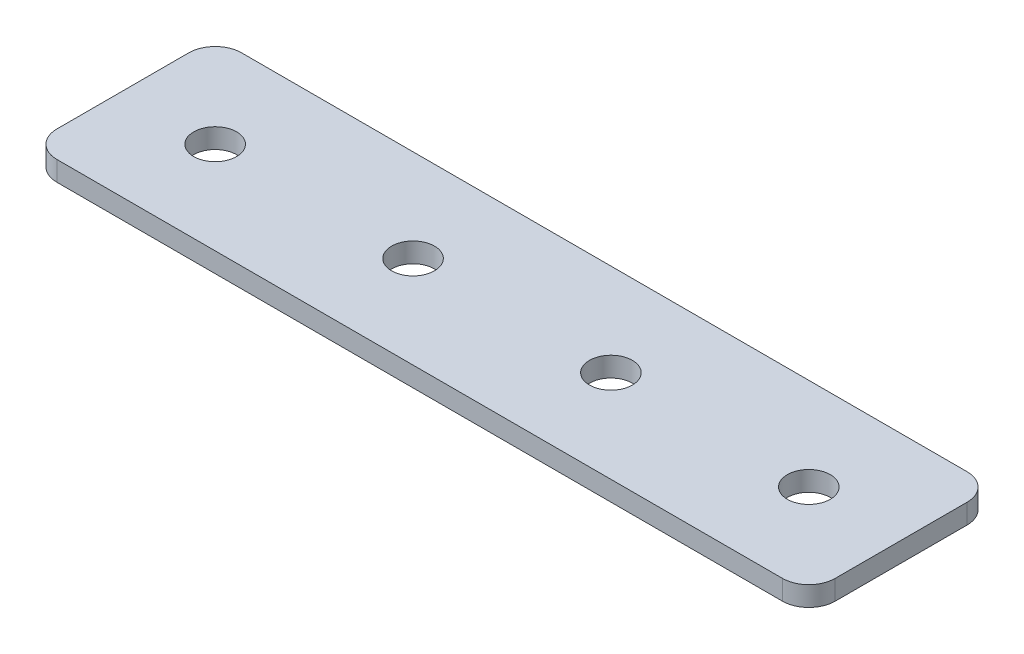
ISO-10303-21;
HEADER;
FILE_DESCRIPTION(('STEP AP214'),'2;1');
FILE_NAME('part.step','',(''),(''),'','','');
FILE_SCHEMA(('AUTOMOTIVE_DESIGN { 1 0 10303 214 1 1 1 1 }'));
ENDSEC;
DATA;
#1=APPLICATION_CONTEXT('core data for automotive mechanical design processes');
#2=APPLICATION_PROTOCOL_DEFINITION('international standard','automotive_design',2000,#1);
#3=PRODUCT_CONTEXT('',#1,'mechanical');
#4=PRODUCT('Part','Part','',(#3));
#5=PRODUCT_RELATED_PRODUCT_CATEGORY('part','',(#4));
#6=PRODUCT_DEFINITION_FORMATION('','',#4);
#7=PRODUCT_DEFINITION_CONTEXT('part definition',#1,'design');
#8=PRODUCT_DEFINITION('design','',#6,#7);
#9=PRODUCT_DEFINITION_SHAPE('','',#8);
#10=(LENGTH_UNIT() NAMED_UNIT(*) SI_UNIT(.MILLI.,.METRE.));
#11=(NAMED_UNIT(*) PLANE_ANGLE_UNIT() SI_UNIT($,.RADIAN.));
#12=(NAMED_UNIT(*) SI_UNIT($,.STERADIAN.) SOLID_ANGLE_UNIT());
#13=UNCERTAINTY_MEASURE_WITH_UNIT(LENGTH_MEASURE(1.E-05),#10,'distance_accuracy_value','');
#14=(GEOMETRIC_REPRESENTATION_CONTEXT(3) GLOBAL_UNCERTAINTY_ASSIGNED_CONTEXT((#13)) GLOBAL_UNIT_ASSIGNED_CONTEXT((#10,
#11,#12)) REPRESENTATION_CONTEXT('',''));
#15=CARTESIAN_POINT('',(0.,0.,0.));
#16=DIRECTION('',(0.,0.,1.));
#17=DIRECTION('',(1.,0.,0.));
#18=AXIS2_PLACEMENT_3D('',#15,#16,#17);
#19=CARTESIAN_POINT('',(-23.4700014306303,1.74134831022957,-1.52094199864905));
#20=DIRECTION('',(0.,-1.,0.));
#21=DIRECTION('',(0.,0.,-1.));
#22=AXIS2_PLACEMENT_3D('',#19,#20,#21);
#23=PLANE('',#22);
#24=CARTESIAN_POINT('',(21.5299985693697,1.74134831022957,-1.52094199864905));
#25=DIRECTION('',(0.,1.,0.));
#26=DIRECTION('',(0.,0.,1.));
#27=AXIS2_PLACEMENT_3D('',#24,#25,#26);
#28=CIRCLE('',#27,1.625);
#29=CARTESIAN_POINT('',(21.5299985693697,1.74134831022957,0.104058001350958));
#30=VERTEX_POINT('',#29);
#31=EDGE_CURVE('E169',#30,#30,#28,.T.);
#32=ORIENTED_EDGE('',*,*,#31,.T.);
#33=EDGE_LOOP('',(#32));
#34=FACE_BOUND('',#33,.T.);
#35=CARTESIAN_POINT('',(6.5299985693697,1.74134831022957,-1.52094199864905));
#36=DIRECTION('',(0.,1.,0.));
#37=DIRECTION('',(0.,0.,1.));
#38=AXIS2_PLACEMENT_3D('',#35,#36,#37);
#39=CIRCLE('',#38,1.625);
#40=CARTESIAN_POINT('',(6.5299985693697,1.74134831022957,0.104058001350958));
#41=VERTEX_POINT('',#40);
#42=EDGE_CURVE('E163',#41,#41,#39,.T.);
#43=ORIENTED_EDGE('',*,*,#42,.T.);
#44=EDGE_LOOP('',(#43));
#45=FACE_BOUND('',#44,.T.);
#46=CARTESIAN_POINT('',(-8.47000143063031,1.74134831022957,-1.52094199864904));
#47=DIRECTION('',(0.,1.,0.));
#48=DIRECTION('',(0.,0.,1.));
#49=AXIS2_PLACEMENT_3D('',#46,#47,#48);
#50=CIRCLE('',#49,1.625);
#51=CARTESIAN_POINT('',(-8.47000143063031,1.74134831022957,0.104058001350964));
#52=VERTEX_POINT('',#51);
#53=EDGE_CURVE('E157',#52,#52,#50,.T.);
#54=ORIENTED_EDGE('',*,*,#53,.T.);
#55=EDGE_LOOP('',(#54));
#56=FACE_BOUND('',#55,.T.);
#57=CARTESIAN_POINT('',(-23.4700014306303,1.74134831022957,-1.52094199864905));
#58=DIRECTION('',(0.,1.,0.));
#59=DIRECTION('',(0.,0.,1.));
#60=AXIS2_PLACEMENT_3D('',#57,#58,#59);
#61=CIRCLE('',#60,1.625);
#62=CARTESIAN_POINT('',(-23.4700014306303,1.74134831022957,0.104058001350954));
#63=VERTEX_POINT('',#62);
#64=EDGE_CURVE('E103',#63,#63,#61,.T.);
#65=ORIENTED_EDGE('',*,*,#64,.T.);
#66=EDGE_LOOP('',(#65));
#67=FACE_BOUND('',#66,.T.);
#68=DIRECTION('',(0.,0.,-1.));
#69=VECTOR('',#68,1.);
#70=CARTESIAN_POINT('',(28.5299985693696,1.74134831022957,5.47905800135099));
#71=LINE('',#70,#69);
#72=CARTESIAN_POINT('',(28.5299985693696,1.74134831022957,3.47905800135099));
#73=VERTEX_POINT('',#72);
#74=CARTESIAN_POINT('',(28.5299985693696,1.74134831022957,-6.52094199864909));
#75=VERTEX_POINT('',#74);
#76=EDGE_CURVE('E150',#73,#75,#71,.T.);
#77=ORIENTED_EDGE('',*,*,#76,.F.);
#78=CARTESIAN_POINT('',(26.5299985693696,1.74134831022957,3.47905800135099));
#79=DIRECTION('',(0.,-1.,0.));
#80=DIRECTION('',(0.,0.,-1.));
#81=AXIS2_PLACEMENT_3D('',#78,#79,#80);
#82=CIRCLE('',#81,2.);
#83=CARTESIAN_POINT('',(26.5299985693696,1.74134831022957,5.47905800135099));
#84=VERTEX_POINT('',#83);
#85=EDGE_CURVE('E130',#73,#84,#82,.T.);
#86=ORIENTED_EDGE('',*,*,#85,.T.);
#87=DIRECTION('',(1.,0.,0.));
#88=VECTOR('',#87,1.);
#89=CARTESIAN_POINT('',(-16.4700014306302,1.74134831022957,5.47905800135099));
#90=LINE('',#89,#88);
#91=CARTESIAN_POINT('',(-28.4700014306304,1.74134831022957,5.47905800135099));
#92=VERTEX_POINT('',#91);
#93=EDGE_CURVE('E146',#92,#84,#90,.T.);
#94=ORIENTED_EDGE('',*,*,#93,.F.);
#95=CARTESIAN_POINT('',(-28.4700014306304,1.74134831022957,3.47905800135099));
#96=DIRECTION('',(0.,-1.,0.));
#97=DIRECTION('',(0.,0.,-1.));
#98=AXIS2_PLACEMENT_3D('',#95,#96,#97);
#99=CIRCLE('',#98,2.);
#100=CARTESIAN_POINT('',(-30.4700014306304,1.74134831022957,3.47905800135099));
#101=VERTEX_POINT('',#100);
#102=EDGE_CURVE('E106',#92,#101,#99,.T.);
#103=ORIENTED_EDGE('',*,*,#102,.T.);
#104=DIRECTION('',(0.,0.,1.));
#105=VECTOR('',#104,1.);
#106=CARTESIAN_POINT('',(-30.4700014306304,1.74134831022957,-8.52094199864908));
#107=LINE('',#106,#105);
#108=CARTESIAN_POINT('',(-30.4700014306304,1.74134831022957,-6.52094199864908));
#109=VERTEX_POINT('',#108);
#110=EDGE_CURVE('E107',#109,#101,#107,.T.);
#111=ORIENTED_EDGE('',*,*,#110,.F.);
#112=CARTESIAN_POINT('',(-28.4700014306304,1.74134831022957,-6.52094199864908));
#113=DIRECTION('',(0.,-1.,0.));
#114=DIRECTION('',(0.,0.,-1.));
#115=AXIS2_PLACEMENT_3D('',#112,#113,#114);
#116=CIRCLE('',#115,2.);
#117=CARTESIAN_POINT('',(-28.4700014306304,1.74134831022957,-8.52094199864908));
#118=VERTEX_POINT('',#117);
#119=EDGE_CURVE('E31',#109,#118,#116,.T.);
#120=ORIENTED_EDGE('',*,*,#119,.T.);
#121=DIRECTION('',(-1.,0.,0.));
#122=VECTOR('',#121,1.);
#123=CARTESIAN_POINT('',(28.5299985693696,1.74134831022957,-8.52094199864909));
#124=LINE('',#123,#122);
#125=CARTESIAN_POINT('',(26.5299985693696,1.74134831022957,-8.52094199864909));
#126=VERTEX_POINT('',#125);
#127=EDGE_CURVE('E111',#126,#118,#124,.T.);
#128=ORIENTED_EDGE('',*,*,#127,.F.);
#129=CARTESIAN_POINT('',(26.5299985693696,1.74134831022957,-6.52094199864909));
#130=DIRECTION('',(0.,-1.,0.));
#131=DIRECTION('',(0.,0.,-1.));
#132=AXIS2_PLACEMENT_3D('',#129,#130,#131);
#133=CIRCLE('',#132,2.);
#134=EDGE_CURVE('E128',#126,#75,#133,.T.);
#135=ORIENTED_EDGE('',*,*,#134,.T.);
#136=EDGE_LOOP('',(#77,#86,#94,#103,#111,#120,#128,#135));
#137=FACE_BOUND('',#136,.T.);
#138=ADVANCED_FACE('F16',(#34,#45,#56,#67,#137),#23,.T.);
#139=CARTESIAN_POINT('',(-16.4700014306302,1.74134831022957,5.47905800135099));
#140=DIRECTION('',(0.,0.,1.));
#141=DIRECTION('',(1.,0.,0.));
#142=AXIS2_PLACEMENT_3D('',#139,#140,#141);
#143=PLANE('',#142);
#144=ORIENTED_EDGE('',*,*,#93,.T.);
#145=DIRECTION('',(0.,1.,0.));
#146=VECTOR('',#145,1.);
#147=CARTESIAN_POINT('',(26.5299985693696,1.74134831022957,5.47905800135099));
#148=LINE('',#147,#146);
#149=CARTESIAN_POINT('',(26.5299985693696,3.24134831022957,5.47905800135099));
#150=VERTEX_POINT('',#149);
#151=EDGE_CURVE('E93',#84,#150,#148,.T.);
#152=ORIENTED_EDGE('',*,*,#151,.T.);
#153=DIRECTION('',(1.,0.,0.));
#154=VECTOR('',#153,1.);
#155=CARTESIAN_POINT('',(-16.4700014306302,3.24134831022957,5.47905800135099));
#156=LINE('',#155,#154);
#157=CARTESIAN_POINT('',(-28.4700014306304,3.24134831022957,5.47905800135099));
#158=VERTEX_POINT('',#157);
#159=EDGE_CURVE('E85',#158,#150,#156,.T.);
#160=ORIENTED_EDGE('',*,*,#159,.F.);
#161=DIRECTION('',(0.,1.,0.));
#162=VECTOR('',#161,1.);
#163=CARTESIAN_POINT('',(-28.4700014306304,1.74134831022957,5.47905800135099));
#164=LINE('',#163,#162);
#165=EDGE_CURVE('E99',#158,#92,#164,.F.);
#166=ORIENTED_EDGE('',*,*,#165,.T.);
#167=EDGE_LOOP('',(#144,#152,#160,#166));
#168=FACE_BOUND('',#167,.T.);
#169=ADVANCED_FACE('F98',(#168),#143,.T.);
#170=CARTESIAN_POINT('',(-30.4700014306304,1.74134831022957,-8.52094199864908));
#171=DIRECTION('',(-1.,0.,0.));
#172=DIRECTION('',(0.,0.,1.));
#173=AXIS2_PLACEMENT_3D('',#170,#171,#172);
#174=PLANE('',#173);
#175=DIRECTION('',(0.,0.,1.));
#176=VECTOR('',#175,1.);
#177=CARTESIAN_POINT('',(-30.4700014306304,3.24134831022957,-8.52094199864908));
#178=LINE('',#177,#176);
#179=CARTESIAN_POINT('',(-30.4700014306304,3.24134831022957,-6.52094199864908));
#180=VERTEX_POINT('',#179);
#181=CARTESIAN_POINT('',(-30.4700014306304,3.24134831022957,3.47905800135099));
#182=VERTEX_POINT('',#181);
#183=EDGE_CURVE('E87',#180,#182,#178,.T.);
#184=ORIENTED_EDGE('',*,*,#183,.F.);
#185=DIRECTION('',(0.,1.,0.));
#186=VECTOR('',#185,1.);
#187=CARTESIAN_POINT('',(-30.4700014306304,1.74134831022957,-6.52094199864908));
#188=LINE('',#187,#186);
#189=EDGE_CURVE('E10',#180,#109,#188,.F.);
#190=ORIENTED_EDGE('',*,*,#189,.T.);
#191=ORIENTED_EDGE('',*,*,#110,.T.);
#192=DIRECTION('',(0.,1.,0.));
#193=VECTOR('',#192,1.);
#194=CARTESIAN_POINT('',(-30.4700014306304,1.74134831022957,3.47905800135099));
#195=LINE('',#194,#193);
#196=EDGE_CURVE('E24',#101,#182,#195,.T.);
#197=ORIENTED_EDGE('',*,*,#196,.T.);
#198=EDGE_LOOP('',(#184,#190,#191,#197));
#199=FACE_BOUND('',#198,.T.);
#200=ADVANCED_FACE('F136',(#199),#174,.T.);
#201=CARTESIAN_POINT('',(28.5299985693696,1.74134831022957,-8.52094199864909));
#202=DIRECTION('',(0.,0.,-1.));
#203=DIRECTION('',(-1.,0.,0.));
#204=AXIS2_PLACEMENT_3D('',#201,#202,#203);
#205=PLANE('',#204);
#206=DIRECTION('',(-1.,0.,0.));
#207=VECTOR('',#206,1.);
#208=CARTESIAN_POINT('',(28.5299985693696,3.24134831022957,-8.52094199864909));
#209=LINE('',#208,#207);
#210=CARTESIAN_POINT('',(26.5299985693696,3.24134831022957,-8.52094199864909));
#211=VERTEX_POINT('',#210);
#212=CARTESIAN_POINT('',(-28.4700014306304,3.24134831022957,-8.52094199864908));
#213=VERTEX_POINT('',#212);
#214=EDGE_CURVE('E144',#211,#213,#209,.T.);
#215=ORIENTED_EDGE('',*,*,#214,.F.);
#216=DIRECTION('',(0.,1.,0.));
#217=VECTOR('',#216,1.);
#218=CARTESIAN_POINT('',(26.5299985693696,1.74134831022957,-8.52094199864909));
#219=LINE('',#218,#217);
#220=EDGE_CURVE('E38',#211,#126,#219,.F.);
#221=ORIENTED_EDGE('',*,*,#220,.T.);
#222=ORIENTED_EDGE('',*,*,#127,.T.);
#223=DIRECTION('',(0.,1.,0.));
#224=VECTOR('',#223,1.);
#225=CARTESIAN_POINT('',(-28.4700014306304,1.74134831022957,-8.52094199864908));
#226=LINE('',#225,#224);
#227=EDGE_CURVE('E132',#118,#213,#226,.T.);
#228=ORIENTED_EDGE('',*,*,#227,.T.);
#229=EDGE_LOOP('',(#215,#221,#222,#228));
#230=FACE_BOUND('',#229,.T.);
#231=ADVANCED_FACE('F143',(#230),#205,.T.);
#232=CARTESIAN_POINT('',(28.5299985693696,1.74134831022957,5.47905800135099));
#233=DIRECTION('',(1.,0.,0.));
#234=DIRECTION('',(0.,0.,-1.));
#235=AXIS2_PLACEMENT_3D('',#232,#233,#234);
#236=PLANE('',#235);
#237=DIRECTION('',(0.,0.,-1.));
#238=VECTOR('',#237,1.);
#239=CARTESIAN_POINT('',(28.5299985693696,3.24134831022957,5.47905800135099));
#240=LINE('',#239,#238);
#241=CARTESIAN_POINT('',(28.5299985693696,3.24134831022957,3.47905800135099));
#242=VERTEX_POINT('',#241);
#243=CARTESIAN_POINT('',(28.5299985693696,3.24134831022957,-6.52094199864909));
#244=VERTEX_POINT('',#243);
#245=EDGE_CURVE('E102',#242,#244,#240,.T.);
#246=ORIENTED_EDGE('',*,*,#245,.F.);
#247=DIRECTION('',(0.,1.,0.));
#248=VECTOR('',#247,1.);
#249=CARTESIAN_POINT('',(28.5299985693696,1.74134831022957,3.47905800135099));
#250=LINE('',#249,#248);
#251=EDGE_CURVE('E124',#242,#73,#250,.F.);
#252=ORIENTED_EDGE('',*,*,#251,.T.);
#253=ORIENTED_EDGE('',*,*,#76,.T.);
#254=DIRECTION('',(0.,1.,0.));
#255=VECTOR('',#254,1.);
#256=CARTESIAN_POINT('',(28.5299985693696,1.74134831022957,-6.52094199864909));
#257=LINE('',#256,#255);
#258=EDGE_CURVE('E121',#75,#244,#257,.T.);
#259=ORIENTED_EDGE('',*,*,#258,.T.);
#260=EDGE_LOOP('',(#246,#252,#253,#259));
#261=FACE_BOUND('',#260,.T.);
#262=ADVANCED_FACE('F191',(#261),#236,.T.);
#263=CARTESIAN_POINT('',(-23.4700014306303,3.24134831022957,-1.52094199864905));
#264=DIRECTION('',(0.,-1.,0.));
#265=DIRECTION('',(0.,0.,-1.));
#266=AXIS2_PLACEMENT_3D('',#263,#264,#265);
#267=PLANE('',#266);
#268=CARTESIAN_POINT('',(21.5299985693697,3.24134831022957,-1.52094199864905));
#269=DIRECTION('',(0.,1.,0.));
#270=DIRECTION('',(0.,0.,1.));
#271=AXIS2_PLACEMENT_3D('',#268,#269,#270);
#272=CIRCLE('',#271,1.625);
#273=CARTESIAN_POINT('',(21.5299985693697,3.24134831022957,0.104058001350958));
#274=VERTEX_POINT('',#273);
#275=EDGE_CURVE('E172',#274,#274,#272,.T.);
#276=ORIENTED_EDGE('',*,*,#275,.F.);
#277=EDGE_LOOP('',(#276));
#278=FACE_BOUND('',#277,.T.);
#279=CARTESIAN_POINT('',(6.5299985693697,3.24134831022957,-1.52094199864905));
#280=DIRECTION('',(0.,1.,0.));
#281=DIRECTION('',(0.,0.,1.));
#282=AXIS2_PLACEMENT_3D('',#279,#280,#281);
#283=CIRCLE('',#282,1.625);
#284=CARTESIAN_POINT('',(6.5299985693697,3.24134831022957,0.104058001350958));
#285=VERTEX_POINT('',#284);
#286=EDGE_CURVE('E166',#285,#285,#283,.T.);
#287=ORIENTED_EDGE('',*,*,#286,.F.);
#288=EDGE_LOOP('',(#287));
#289=FACE_BOUND('',#288,.T.);
#290=CARTESIAN_POINT('',(-8.47000143063031,3.24134831022957,-1.52094199864904));
#291=DIRECTION('',(0.,1.,0.));
#292=DIRECTION('',(0.,0.,1.));
#293=AXIS2_PLACEMENT_3D('',#290,#291,#292);
#294=CIRCLE('',#293,1.625);
#295=CARTESIAN_POINT('',(-8.47000143063031,3.24134831022957,0.104058001350964));
#296=VERTEX_POINT('',#295);
#297=EDGE_CURVE('E160',#296,#296,#294,.T.);
#298=ORIENTED_EDGE('',*,*,#297,.F.);
#299=EDGE_LOOP('',(#298));
#300=FACE_BOUND('',#299,.T.);
#301=CARTESIAN_POINT('',(-23.4700014306303,3.24134831022957,-1.52094199864905));
#302=DIRECTION('',(0.,1.,0.));
#303=DIRECTION('',(0.,0.,1.));
#304=AXIS2_PLACEMENT_3D('',#301,#302,#303);
#305=CIRCLE('',#304,1.625);
#306=CARTESIAN_POINT('',(-23.4700014306303,3.24134831022957,0.104058001350954));
#307=VERTEX_POINT('',#306);
#308=EDGE_CURVE('E154',#307,#307,#305,.T.);
#309=ORIENTED_EDGE('',*,*,#308,.F.);
#310=EDGE_LOOP('',(#309));
#311=FACE_BOUND('',#310,.T.);
#312=ORIENTED_EDGE('',*,*,#159,.T.);
#313=CARTESIAN_POINT('',(26.5299985693696,3.24134831022957,3.47905800135099));
#314=DIRECTION('',(0.,-1.,0.));
#315=DIRECTION('',(0.,0.,-1.));
#316=AXIS2_PLACEMENT_3D('',#313,#314,#315);
#317=CIRCLE('',#316,2.);
#318=EDGE_CURVE('E119',#150,#242,#317,.F.);
#319=ORIENTED_EDGE('',*,*,#318,.T.);
#320=ORIENTED_EDGE('',*,*,#245,.T.);
#321=CARTESIAN_POINT('',(26.5299985693696,3.24134831022957,-6.52094199864909));
#322=DIRECTION('',(0.,-1.,0.));
#323=DIRECTION('',(0.,0.,-1.));
#324=AXIS2_PLACEMENT_3D('',#321,#322,#323);
#325=CIRCLE('',#324,2.);
#326=EDGE_CURVE('E117',#244,#211,#325,.F.);
#327=ORIENTED_EDGE('',*,*,#326,.T.);
#328=ORIENTED_EDGE('',*,*,#214,.T.);
#329=CARTESIAN_POINT('',(-28.4700014306304,3.24134831022957,-6.52094199864908));
#330=DIRECTION('',(0.,-1.,0.));
#331=DIRECTION('',(0.,0.,-1.));
#332=AXIS2_PLACEMENT_3D('',#329,#330,#331);
#333=CIRCLE('',#332,2.);
#334=EDGE_CURVE('E92',#213,#180,#333,.F.);
#335=ORIENTED_EDGE('',*,*,#334,.T.);
#336=ORIENTED_EDGE('',*,*,#183,.T.);
#337=CARTESIAN_POINT('',(-28.4700014306304,3.24134831022957,3.47905800135099));
#338=DIRECTION('',(0.,-1.,0.));
#339=DIRECTION('',(0.,0.,-1.));
#340=AXIS2_PLACEMENT_3D('',#337,#338,#339);
#341=CIRCLE('',#340,2.);
#342=EDGE_CURVE('E82',#182,#158,#341,.F.);
#343=ORIENTED_EDGE('',*,*,#342,.T.);
#344=EDGE_LOOP('',(#312,#319,#320,#327,#328,#335,#336,#343));
#345=FACE_BOUND('',#344,.T.);
#346=ADVANCED_FACE('F84',(#278,#289,#300,#311,#345),#267,.F.);
#347=CARTESIAN_POINT('',(-23.4700014306303,1.74134831022957,-1.52094199864905));
#348=DIRECTION('',(0.,1.,0.));
#349=DIRECTION('',(0.,0.,1.));
#350=AXIS2_PLACEMENT_3D('',#347,#348,#349);
#351=CYLINDRICAL_SURFACE('',#350,1.625);
#352=ORIENTED_EDGE('',*,*,#64,.F.);
#353=EDGE_LOOP('',(#352));
#354=FACE_BOUND('',#353,.T.);
#355=ORIENTED_EDGE('',*,*,#308,.T.);
#356=EDGE_LOOP('',(#355));
#357=FACE_BOUND('',#356,.T.);
#358=ADVANCED_FACE('F190',(#354,#357),#351,.F.);
#359=CARTESIAN_POINT('',(-8.47000143063031,1.74134831022957,-1.52094199864904));
#360=DIRECTION('',(0.,1.,0.));
#361=DIRECTION('',(0.,0.,1.));
#362=AXIS2_PLACEMENT_3D('',#359,#360,#361);
#363=CYLINDRICAL_SURFACE('',#362,1.625);
#364=ORIENTED_EDGE('',*,*,#53,.F.);
#365=EDGE_LOOP('',(#364));
#366=FACE_BOUND('',#365,.T.);
#367=ORIENTED_EDGE('',*,*,#297,.T.);
#368=EDGE_LOOP('',(#367));
#369=FACE_BOUND('',#368,.T.);
#370=ADVANCED_FACE('F200',(#366,#369),#363,.F.);
#371=CARTESIAN_POINT('',(6.5299985693697,1.74134831022957,-1.52094199864905));
#372=DIRECTION('',(0.,1.,0.));
#373=DIRECTION('',(0.,0.,1.));
#374=AXIS2_PLACEMENT_3D('',#371,#372,#373);
#375=CYLINDRICAL_SURFACE('',#374,1.625);
#376=ORIENTED_EDGE('',*,*,#42,.F.);
#377=EDGE_LOOP('',(#376));
#378=FACE_BOUND('',#377,.T.);
#379=ORIENTED_EDGE('',*,*,#286,.T.);
#380=EDGE_LOOP('',(#379));
#381=FACE_BOUND('',#380,.T.);
#382=ADVANCED_FACE('F184',(#378,#381),#375,.F.);
#383=CARTESIAN_POINT('',(21.5299985693697,1.74134831022957,-1.52094199864905));
#384=DIRECTION('',(0.,1.,0.));
#385=DIRECTION('',(0.,0.,1.));
#386=AXIS2_PLACEMENT_3D('',#383,#384,#385);
#387=CYLINDRICAL_SURFACE('',#386,1.625);
#388=ORIENTED_EDGE('',*,*,#31,.F.);
#389=EDGE_LOOP('',(#388));
#390=FACE_BOUND('',#389,.T.);
#391=ORIENTED_EDGE('',*,*,#275,.T.);
#392=EDGE_LOOP('',(#391));
#393=FACE_BOUND('',#392,.T.);
#394=ADVANCED_FACE('F180',(#390,#393),#387,.F.);
#395=CARTESIAN_POINT('',(26.5299985693696,1.74134831022957,3.47905800135099));
#396=DIRECTION('',(0.,1.,0.));
#397=DIRECTION('',(0.,0.,1.));
#398=AXIS2_PLACEMENT_3D('',#395,#396,#397);
#399=CYLINDRICAL_SURFACE('',#398,2.);
#400=ORIENTED_EDGE('',*,*,#85,.F.);
#401=ORIENTED_EDGE('',*,*,#251,.F.);
#402=ORIENTED_EDGE('',*,*,#318,.F.);
#403=ORIENTED_EDGE('',*,*,#151,.F.);
#404=EDGE_LOOP('',(#400,#401,#402,#403));
#405=FACE_BOUND('',#404,.T.);
#406=ADVANCED_FACE('F183',(#405),#399,.T.);
#407=CARTESIAN_POINT('',(26.5299985693696,1.74134831022957,-6.52094199864909));
#408=DIRECTION('',(0.,1.,0.));
#409=DIRECTION('',(0.,0.,1.));
#410=AXIS2_PLACEMENT_3D('',#407,#408,#409);
#411=CYLINDRICAL_SURFACE('',#410,2.);
#412=ORIENTED_EDGE('',*,*,#134,.F.);
#413=ORIENTED_EDGE('',*,*,#220,.F.);
#414=ORIENTED_EDGE('',*,*,#326,.F.);
#415=ORIENTED_EDGE('',*,*,#258,.F.);
#416=EDGE_LOOP('',(#412,#413,#414,#415));
#417=FACE_BOUND('',#416,.T.);
#418=ADVANCED_FACE('F220',(#417),#411,.T.);
#419=CARTESIAN_POINT('',(-28.4700014306304,1.74134831022957,-6.52094199864908));
#420=DIRECTION('',(0.,1.,0.));
#421=DIRECTION('',(0.,0.,1.));
#422=AXIS2_PLACEMENT_3D('',#419,#420,#421);
#423=CYLINDRICAL_SURFACE('',#422,2.);
#424=ORIENTED_EDGE('',*,*,#119,.F.);
#425=ORIENTED_EDGE('',*,*,#189,.F.);
#426=ORIENTED_EDGE('',*,*,#334,.F.);
#427=ORIENTED_EDGE('',*,*,#227,.F.);
#428=EDGE_LOOP('',(#424,#425,#426,#427));
#429=FACE_BOUND('',#428,.T.);
#430=ADVANCED_FACE('F141',(#429),#423,.T.);
#431=CARTESIAN_POINT('',(-28.4700014306304,1.74134831022957,3.47905800135099));
#432=DIRECTION('',(0.,1.,0.));
#433=DIRECTION('',(0.,0.,1.));
#434=AXIS2_PLACEMENT_3D('',#431,#432,#433);
#435=CYLINDRICAL_SURFACE('',#434,2.);
#436=ORIENTED_EDGE('',*,*,#102,.F.);
#437=ORIENTED_EDGE('',*,*,#165,.F.);
#438=ORIENTED_EDGE('',*,*,#342,.F.);
#439=ORIENTED_EDGE('',*,*,#196,.F.);
#440=EDGE_LOOP('',(#436,#437,#438,#439));
#441=FACE_BOUND('',#440,.T.);
#442=ADVANCED_FACE('F18',(#441),#435,.T.);
#443=CLOSED_SHELL('',(#138,#169,#200,#231,#262,#346,#358,#370,#382,#394,#406,#418,#430,#442));
#444=MANIFOLD_SOLID_BREP('B1',#443);
#445=ADVANCED_BREP_SHAPE_REPRESENTATION('',(#18,#444),#14);
#446=SHAPE_DEFINITION_REPRESENTATION(#9,#445);
ENDSEC;
END-ISO-10303-21;
